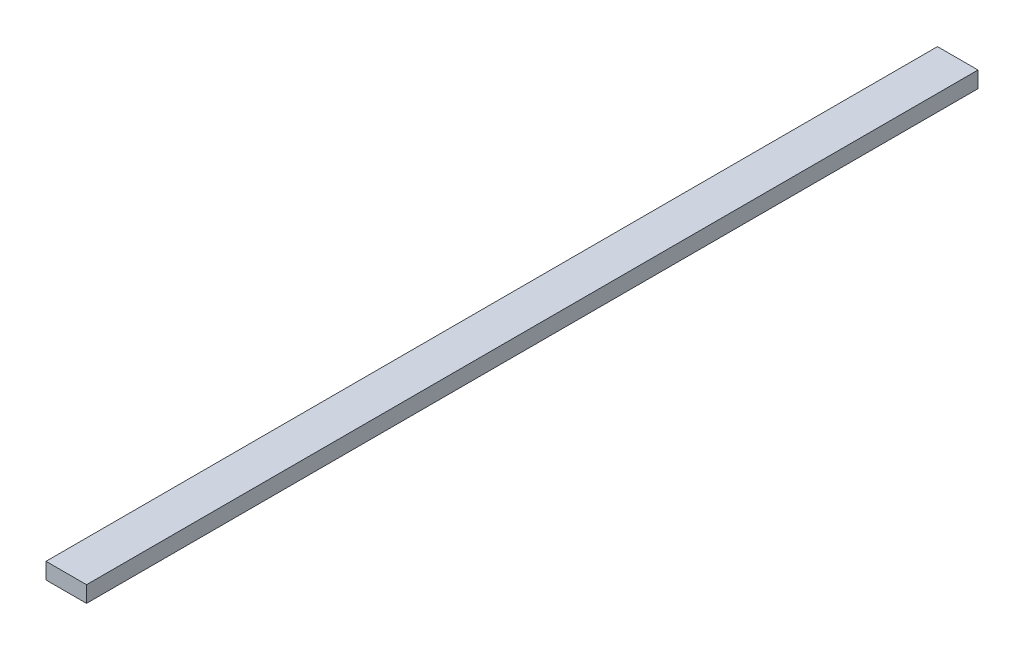
ISO-10303-21;
HEADER;
FILE_DESCRIPTION(('STEP AP214'),'2;1');
FILE_NAME('part.step','',(''),(''),'','','');
FILE_SCHEMA(('AUTOMOTIVE_DESIGN { 1 0 10303 214 1 1 1 1 }'));
ENDSEC;
DATA;
#1=APPLICATION_CONTEXT('core data for automotive mechanical design processes');
#2=APPLICATION_PROTOCOL_DEFINITION('international standard','automotive_design',2000,#1);
#3=PRODUCT_CONTEXT('',#1,'mechanical');
#4=PRODUCT('Part','Part','',(#3));
#5=PRODUCT_RELATED_PRODUCT_CATEGORY('part','',(#4));
#6=PRODUCT_DEFINITION_FORMATION('','',#4);
#7=PRODUCT_DEFINITION_CONTEXT('part definition',#1,'design');
#8=PRODUCT_DEFINITION('design','',#6,#7);
#9=PRODUCT_DEFINITION_SHAPE('','',#8);
#10=(LENGTH_UNIT() NAMED_UNIT(*) SI_UNIT(.MILLI.,.METRE.));
#11=(NAMED_UNIT(*) PLANE_ANGLE_UNIT() SI_UNIT($,.RADIAN.));
#12=(NAMED_UNIT(*) SI_UNIT($,.STERADIAN.) SOLID_ANGLE_UNIT());
#13=UNCERTAINTY_MEASURE_WITH_UNIT(LENGTH_MEASURE(1.E-05),#10,'distance_accuracy_value','');
#14=(GEOMETRIC_REPRESENTATION_CONTEXT(3) GLOBAL_UNCERTAINTY_ASSIGNED_CONTEXT((#13)) GLOBAL_UNIT_ASSIGNED_CONTEXT((#10,
#11,#12)) REPRESENTATION_CONTEXT('',''));
#15=CARTESIAN_POINT('',(0.,0.,0.));
#16=DIRECTION('',(0.,0.,1.));
#17=DIRECTION('',(1.,0.,0.));
#18=AXIS2_PLACEMENT_3D('',#15,#16,#17);
#19=CARTESIAN_POINT('',(0.,10.,0.));
#20=DIRECTION('',(1.,0.,0.));
#21=DIRECTION('',(0.,0.,-1.));
#22=AXIS2_PLACEMENT_3D('',#19,#20,#21);
#23=PLANE('',#22);
#24=DIRECTION('',(0.,0.,1.));
#25=VECTOR('',#24,1.);
#26=CARTESIAN_POINT('',(0.,0.,0.));
#27=LINE('',#26,#25);
#28=CARTESIAN_POINT('',(0.,0.,-550.));
#29=VERTEX_POINT('',#28);
#30=CARTESIAN_POINT('',(0.,0.,0.));
#31=VERTEX_POINT('',#30);
#32=EDGE_CURVE('E97',#29,#31,#27,.T.);
#33=ORIENTED_EDGE('',*,*,#32,.T.);
#34=DIRECTION('',(0.,-1.,0.));
#35=VECTOR('',#34,1.);
#36=CARTESIAN_POINT('',(0.,10.,0.));
#37=LINE('',#36,#35);
#38=CARTESIAN_POINT('',(0.,10.,0.));
#39=VERTEX_POINT('',#38);
#40=EDGE_CURVE('E11',#39,#31,#37,.T.);
#41=ORIENTED_EDGE('',*,*,#40,.F.);
#42=DIRECTION('',(0.,0.,1.));
#43=VECTOR('',#42,1.);
#44=CARTESIAN_POINT('',(0.,10.,0.));
#45=LINE('',#44,#43);
#46=CARTESIAN_POINT('',(0.,10.,-550.));
#47=VERTEX_POINT('',#46);
#48=EDGE_CURVE('E85',#47,#39,#45,.T.);
#49=ORIENTED_EDGE('',*,*,#48,.F.);
#50=DIRECTION('',(0.,-1.,0.));
#51=VECTOR('',#50,1.);
#52=CARTESIAN_POINT('',(0.,10.,-550.));
#53=LINE('',#52,#51);
#54=EDGE_CURVE('E93',#47,#29,#53,.T.);
#55=ORIENTED_EDGE('',*,*,#54,.T.);
#56=EDGE_LOOP('',(#33,#41,#49,#55));
#57=FACE_BOUND('',#56,.T.);
#58=ADVANCED_FACE('F34',(#57),#23,.F.);
#59=CARTESIAN_POINT('',(0.,10.,0.));
#60=DIRECTION('',(0.,0.,-1.));
#61=DIRECTION('',(-1.,0.,0.));
#62=AXIS2_PLACEMENT_3D('',#59,#60,#61);
#63=PLANE('',#62);
#64=DIRECTION('',(1.,0.,0.));
#65=VECTOR('',#64,1.);
#66=CARTESIAN_POINT('',(0.,0.,0.));
#67=LINE('',#66,#65);
#68=CARTESIAN_POINT('',(25.,0.,0.));
#69=VERTEX_POINT('',#68);
#70=EDGE_CURVE('E89',#31,#69,#67,.T.);
#71=ORIENTED_EDGE('',*,*,#70,.T.);
#72=DIRECTION('',(0.,-1.,0.));
#73=VECTOR('',#72,1.);
#74=CARTESIAN_POINT('',(25.,10.,0.));
#75=LINE('',#74,#73);
#76=CARTESIAN_POINT('',(25.,10.,0.));
#77=VERTEX_POINT('',#76);
#78=EDGE_CURVE('E42',#77,#69,#75,.T.);
#79=ORIENTED_EDGE('',*,*,#78,.F.);
#80=DIRECTION('',(1.,0.,0.));
#81=VECTOR('',#80,1.);
#82=CARTESIAN_POINT('',(0.,10.,0.));
#83=LINE('',#82,#81);
#84=EDGE_CURVE('E80',#39,#77,#83,.T.);
#85=ORIENTED_EDGE('',*,*,#84,.F.);
#86=ORIENTED_EDGE('',*,*,#40,.T.);
#87=EDGE_LOOP('',(#71,#79,#85,#86));
#88=FACE_BOUND('',#87,.T.);
#89=ADVANCED_FACE('F88',(#88),#63,.F.);
#90=CARTESIAN_POINT('',(25.,10.,0.));
#91=DIRECTION('',(-1.,0.,0.));
#92=DIRECTION('',(0.,0.,1.));
#93=AXIS2_PLACEMENT_3D('',#90,#91,#92);
#94=PLANE('',#93);
#95=DIRECTION('',(0.,0.,-1.));
#96=VECTOR('',#95,1.);
#97=CARTESIAN_POINT('',(25.,0.,0.));
#98=LINE('',#97,#96);
#99=CARTESIAN_POINT('',(25.,0.,-550.));
#100=VERTEX_POINT('',#99);
#101=EDGE_CURVE('E67',#69,#100,#98,.T.);
#102=ORIENTED_EDGE('',*,*,#101,.T.);
#103=DIRECTION('',(0.,-1.,0.));
#104=VECTOR('',#103,1.);
#105=CARTESIAN_POINT('',(25.,10.,-550.));
#106=LINE('',#105,#104);
#107=CARTESIAN_POINT('',(25.,10.,-550.));
#108=VERTEX_POINT('',#107);
#109=EDGE_CURVE('E90',#108,#100,#106,.T.);
#110=ORIENTED_EDGE('',*,*,#109,.F.);
#111=DIRECTION('',(0.,0.,-1.));
#112=VECTOR('',#111,1.);
#113=CARTESIAN_POINT('',(25.,10.,0.));
#114=LINE('',#113,#112);
#115=EDGE_CURVE('E83',#77,#108,#114,.T.);
#116=ORIENTED_EDGE('',*,*,#115,.F.);
#117=ORIENTED_EDGE('',*,*,#78,.T.);
#118=EDGE_LOOP('',(#102,#110,#116,#117));
#119=FACE_BOUND('',#118,.T.);
#120=ADVANCED_FACE('F91',(#119),#94,.F.);
#121=CARTESIAN_POINT('',(0.,10.,-550.));
#122=DIRECTION('',(0.,0.,1.));
#123=DIRECTION('',(1.,0.,0.));
#124=AXIS2_PLACEMENT_3D('',#121,#122,#123);
#125=PLANE('',#124);
#126=DIRECTION('',(-1.,0.,0.));
#127=VECTOR('',#126,1.);
#128=CARTESIAN_POINT('',(0.,0.,-550.));
#129=LINE('',#128,#127);
#130=EDGE_CURVE('E73',#100,#29,#129,.T.);
#131=ORIENTED_EDGE('',*,*,#130,.T.);
#132=ORIENTED_EDGE('',*,*,#54,.F.);
#133=DIRECTION('',(-1.,0.,0.));
#134=VECTOR('',#133,1.);
#135=CARTESIAN_POINT('',(0.,10.,-550.));
#136=LINE('',#135,#134);
#137=EDGE_CURVE('E50',#108,#47,#136,.T.);
#138=ORIENTED_EDGE('',*,*,#137,.F.);
#139=ORIENTED_EDGE('',*,*,#109,.T.);
#140=EDGE_LOOP('',(#131,#132,#138,#139));
#141=FACE_BOUND('',#140,.T.);
#142=ADVANCED_FACE('F104',(#141),#125,.F.);
#143=CARTESIAN_POINT('',(0.,10.,0.));
#144=DIRECTION('',(0.,-1.,0.));
#145=DIRECTION('',(0.,0.,-1.));
#146=AXIS2_PLACEMENT_3D('',#143,#144,#145);
#147=PLANE('',#146);
#148=ORIENTED_EDGE('',*,*,#48,.T.);
#149=ORIENTED_EDGE('',*,*,#84,.T.);
#150=ORIENTED_EDGE('',*,*,#115,.T.);
#151=ORIENTED_EDGE('',*,*,#137,.T.);
#152=EDGE_LOOP('',(#148,#149,#150,#151));
#153=FACE_BOUND('',#152,.T.);
#154=ADVANCED_FACE('F81',(#153),#147,.F.);
#155=CARTESIAN_POINT('',(0.,0.,0.));
#156=DIRECTION('',(0.,-1.,0.));
#157=DIRECTION('',(0.,0.,-1.));
#158=AXIS2_PLACEMENT_3D('',#155,#156,#157);
#159=PLANE('',#158);
#160=ORIENTED_EDGE('',*,*,#32,.F.);
#161=ORIENTED_EDGE('',*,*,#130,.F.);
#162=ORIENTED_EDGE('',*,*,#101,.F.);
#163=ORIENTED_EDGE('',*,*,#70,.F.);
#164=EDGE_LOOP('',(#160,#161,#162,#163));
#165=FACE_BOUND('',#164,.T.);
#166=ADVANCED_FACE('F107',(#165),#159,.T.);
#167=CLOSED_SHELL('',(#58,#89,#120,#142,#154,#166));
#168=MANIFOLD_SOLID_BREP('B2',#167);
#169=ADVANCED_BREP_SHAPE_REPRESENTATION('',(#18,#168),#14);
#170=SHAPE_DEFINITION_REPRESENTATION(#9,#169);
ENDSEC;
END-ISO-10303-21;
